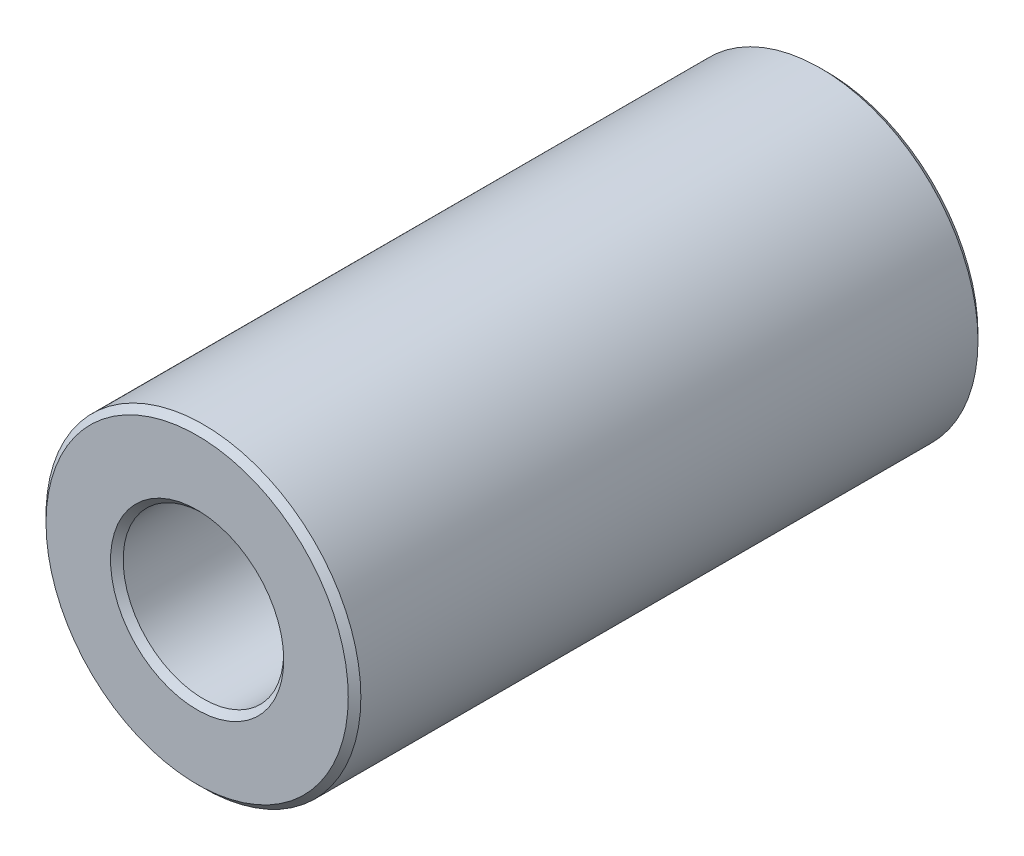
ISO-10303-21;
HEADER;
FILE_DESCRIPTION(('STEP AP214'),'2;1');
FILE_NAME('part.step','',(''),(''),'','','');
FILE_SCHEMA(('AUTOMOTIVE_DESIGN { 1 0 10303 214 1 1 1 1 }'));
ENDSEC;
DATA;
#1=APPLICATION_CONTEXT('core data for automotive mechanical design processes');
#2=APPLICATION_PROTOCOL_DEFINITION('international standard','automotive_design',2000,#1);
#3=PRODUCT_CONTEXT('',#1,'mechanical');
#4=PRODUCT('Part','Part','',(#3));
#5=PRODUCT_RELATED_PRODUCT_CATEGORY('part','',(#4));
#6=PRODUCT_DEFINITION_FORMATION('','',#4);
#7=PRODUCT_DEFINITION_CONTEXT('part definition',#1,'design');
#8=PRODUCT_DEFINITION('design','',#6,#7);
#9=PRODUCT_DEFINITION_SHAPE('','',#8);
#10=(LENGTH_UNIT() NAMED_UNIT(*) SI_UNIT(.MILLI.,.METRE.));
#11=(NAMED_UNIT(*) PLANE_ANGLE_UNIT() SI_UNIT($,.RADIAN.));
#12=(NAMED_UNIT(*) SI_UNIT($,.STERADIAN.) SOLID_ANGLE_UNIT());
#13=UNCERTAINTY_MEASURE_WITH_UNIT(LENGTH_MEASURE(1.E-05),#10,'distance_accuracy_value','');
#14=(GEOMETRIC_REPRESENTATION_CONTEXT(3) GLOBAL_UNCERTAINTY_ASSIGNED_CONTEXT((#13)) GLOBAL_UNIT_ASSIGNED_CONTEXT((#10,
#11,#12)) REPRESENTATION_CONTEXT('',''));
#15=CARTESIAN_POINT('',(0.,0.,0.));
#16=DIRECTION('',(0.,0.,1.));
#17=DIRECTION('',(1.,0.,0.));
#18=AXIS2_PLACEMENT_3D('',#15,#16,#17);
#19=CARTESIAN_POINT('',(0.,0.,20.));
#20=DIRECTION('',(0.,0.,1.));
#21=DIRECTION('',(1.,0.,0.));
#22=AXIS2_PLACEMENT_3D('',#19,#20,#21);
#23=PLANE('',#22);
#24=CARTESIAN_POINT('',(0.,0.,20.));
#25=DIRECTION('',(0.,0.,1.));
#26=DIRECTION('',(1.,0.,0.));
#27=AXIS2_PLACEMENT_3D('',#24,#25,#26);
#28=CIRCLE('',#27,2.75);
#29=CARTESIAN_POINT('',(2.75,0.,20.));
#30=VERTEX_POINT('',#29);
#31=EDGE_CURVE('E10',#30,#30,#28,.F.);
#32=ORIENTED_EDGE('',*,*,#31,.T.);
#33=EDGE_LOOP('',(#32));
#34=FACE_BOUND('',#33,.T.);
#35=CARTESIAN_POINT('',(0.,0.,20.));
#36=DIRECTION('',(0.,0.,1.));
#37=DIRECTION('',(1.,0.,0.));
#38=AXIS2_PLACEMENT_3D('',#35,#36,#37);
#39=CIRCLE('',#38,4.8);
#40=CARTESIAN_POINT('',(4.8,0.,20.));
#41=VERTEX_POINT('',#40);
#42=EDGE_CURVE('E39',#41,#41,#39,.T.);
#43=ORIENTED_EDGE('',*,*,#42,.T.);
#44=EDGE_LOOP('',(#43));
#45=FACE_BOUND('',#44,.T.);
#46=ADVANCED_FACE('F32',(#34,#45),#23,.T.);
#47=CARTESIAN_POINT('',(0.,0.,0.));
#48=DIRECTION('',(0.,0.,1.));
#49=DIRECTION('',(1.,0.,0.));
#50=AXIS2_PLACEMENT_3D('',#47,#48,#49);
#51=PLANE('',#50);
#52=CARTESIAN_POINT('',(0.,0.,0.));
#53=DIRECTION('',(0.,0.,1.));
#54=DIRECTION('',(1.,0.,0.));
#55=AXIS2_PLACEMENT_3D('',#52,#53,#54);
#56=CIRCLE('',#55,4.8);
#57=CARTESIAN_POINT('',(4.8,0.,0.));
#58=VERTEX_POINT('',#57);
#59=EDGE_CURVE('E52',#58,#58,#56,.F.);
#60=ORIENTED_EDGE('',*,*,#59,.T.);
#61=EDGE_LOOP('',(#60));
#62=FACE_BOUND('',#61,.T.);
#63=CARTESIAN_POINT('',(0.,0.,0.));
#64=DIRECTION('',(0.,0.,1.));
#65=DIRECTION('',(1.,0.,0.));
#66=AXIS2_PLACEMENT_3D('',#63,#64,#65);
#67=CIRCLE('',#66,2.75);
#68=CARTESIAN_POINT('',(2.75,0.,0.));
#69=VERTEX_POINT('',#68);
#70=EDGE_CURVE('E55',#69,#69,#67,.T.);
#71=ORIENTED_EDGE('',*,*,#70,.T.);
#72=EDGE_LOOP('',(#71));
#73=FACE_BOUND('',#72,.T.);
#74=ADVANCED_FACE('F76',(#62,#73),#51,.F.);
#75=CARTESIAN_POINT('',(0.,0.,20.));
#76=DIRECTION('',(0.,0.,-1.));
#77=DIRECTION('',(-1.,0.,0.));
#78=AXIS2_PLACEMENT_3D('',#75,#76,#77);
#79=CYLINDRICAL_SURFACE('',#78,5.);
#80=CARTESIAN_POINT('',(0.,0.,0.200000000000002));
#81=DIRECTION('',(0.,0.,1.));
#82=DIRECTION('',(1.,0.,0.));
#83=AXIS2_PLACEMENT_3D('',#80,#81,#82);
#84=CIRCLE('',#83,5.);
#85=CARTESIAN_POINT('',(5.,0.,0.200000000000002));
#86=VERTEX_POINT('',#85);
#87=EDGE_CURVE('E58',#86,#86,#84,.T.);
#88=ORIENTED_EDGE('',*,*,#87,.T.);
#89=EDGE_LOOP('',(#88));
#90=FACE_BOUND('',#89,.T.);
#91=CARTESIAN_POINT('',(0.,0.,19.8));
#92=DIRECTION('',(0.,0.,1.));
#93=DIRECTION('',(1.,0.,0.));
#94=AXIS2_PLACEMENT_3D('',#91,#92,#93);
#95=CIRCLE('',#94,5.);
#96=CARTESIAN_POINT('',(5.,0.,19.8));
#97=VERTEX_POINT('',#96);
#98=EDGE_CURVE('E61',#97,#97,#95,.F.);
#99=ORIENTED_EDGE('',*,*,#98,.T.);
#100=EDGE_LOOP('',(#99));
#101=FACE_BOUND('',#100,.T.);
#102=ADVANCED_FACE('F65',(#90,#101),#79,.T.);
#103=CARTESIAN_POINT('',(0.,0.,20.));
#104=DIRECTION('',(0.,0.,-1.));
#105=DIRECTION('',(-1.,0.,0.));
#106=AXIS2_PLACEMENT_3D('',#103,#104,#105);
#107=CYLINDRICAL_SURFACE('',#106,2.55);
#108=CARTESIAN_POINT('',(0.,0.,0.199999999999999));
#109=DIRECTION('',(0.,0.,1.));
#110=DIRECTION('',(1.,0.,0.));
#111=AXIS2_PLACEMENT_3D('',#108,#109,#110);
#112=CIRCLE('',#111,2.55);
#113=CARTESIAN_POINT('',(2.55,0.,0.199999999999999));
#114=VERTEX_POINT('',#113);
#115=EDGE_CURVE('E43',#114,#114,#112,.F.);
#116=ORIENTED_EDGE('',*,*,#115,.T.);
#117=EDGE_LOOP('',(#116));
#118=FACE_BOUND('',#117,.T.);
#119=CARTESIAN_POINT('',(0.,0.,19.8));
#120=DIRECTION('',(0.,0.,1.));
#121=DIRECTION('',(1.,0.,0.));
#122=AXIS2_PLACEMENT_3D('',#119,#120,#121);
#123=CIRCLE('',#122,2.55);
#124=CARTESIAN_POINT('',(2.55,0.,19.8));
#125=VERTEX_POINT('',#124);
#126=EDGE_CURVE('E47',#125,#125,#123,.T.);
#127=ORIENTED_EDGE('',*,*,#126,.T.);
#128=EDGE_LOOP('',(#127));
#129=FACE_BOUND('',#128,.T.);
#130=ADVANCED_FACE('F84',(#118,#129),#107,.F.);
#131=CARTESIAN_POINT('',(0.,0.,0.200000000000002));
#132=DIRECTION('',(0.,0.,1.));
#133=DIRECTION('',(1.,0.,0.));
#134=AXIS2_PLACEMENT_3D('',#131,#132,#133);
#135=CONICAL_SURFACE('',#134,5.,0.78539816339745);
#136=ORIENTED_EDGE('',*,*,#59,.F.);
#137=EDGE_LOOP('',(#136));
#138=FACE_BOUND('',#137,.T.);
#139=ORIENTED_EDGE('',*,*,#87,.F.);
#140=EDGE_LOOP('',(#139));
#141=FACE_BOUND('',#140,.T.);
#142=ADVANCED_FACE('F89',(#138,#141),#135,.T.);
#143=CARTESIAN_POINT('',(0.,0.,0.));
#144=DIRECTION('',(0.,0.,-1.));
#145=DIRECTION('',(-1.,0.,0.));
#146=AXIS2_PLACEMENT_3D('',#143,#144,#145);
#147=CONICAL_SURFACE('',#146,2.75,0.785398163397449);
#148=ORIENTED_EDGE('',*,*,#115,.F.);
#149=EDGE_LOOP('',(#148));
#150=FACE_BOUND('',#149,.T.);
#151=ORIENTED_EDGE('',*,*,#70,.F.);
#152=EDGE_LOOP('',(#151));
#153=FACE_BOUND('',#152,.T.);
#154=ADVANCED_FACE('F73',(#150,#153),#147,.F.);
#155=CARTESIAN_POINT('',(0.,0.,19.8));
#156=DIRECTION('',(0.,0.,1.));
#157=DIRECTION('',(1.,0.,0.));
#158=AXIS2_PLACEMENT_3D('',#155,#156,#157);
#159=CONICAL_SURFACE('',#158,2.55,0.785398163397449);
#160=ORIENTED_EDGE('',*,*,#31,.F.);
#161=EDGE_LOOP('',(#160));
#162=FACE_BOUND('',#161,.T.);
#163=ORIENTED_EDGE('',*,*,#126,.F.);
#164=EDGE_LOOP('',(#163));
#165=FACE_BOUND('',#164,.T.);
#166=ADVANCED_FACE('F69',(#162,#165),#159,.F.);
#167=CARTESIAN_POINT('',(0.,0.,20.));
#168=DIRECTION('',(0.,0.,-1.));
#169=DIRECTION('',(-1.,0.,0.));
#170=AXIS2_PLACEMENT_3D('',#167,#168,#169);
#171=CONICAL_SURFACE('',#170,4.8,0.785398163397455);
#172=ORIENTED_EDGE('',*,*,#98,.F.);
#173=EDGE_LOOP('',(#172));
#174=FACE_BOUND('',#173,.T.);
#175=ORIENTED_EDGE('',*,*,#42,.F.);
#176=EDGE_LOOP('',(#175));
#177=FACE_BOUND('',#176,.T.);
#178=ADVANCED_FACE('F34',(#174,#177),#171,.T.);
#179=CLOSED_SHELL('',(#46,#74,#102,#130,#142,#154,#166,#178));
#180=MANIFOLD_SOLID_BREP('B2',#179);
#181=ADVANCED_BREP_SHAPE_REPRESENTATION('',(#18,#180),#14);
#182=SHAPE_DEFINITION_REPRESENTATION(#9,#181);
ENDSEC;
END-ISO-10303-21;
